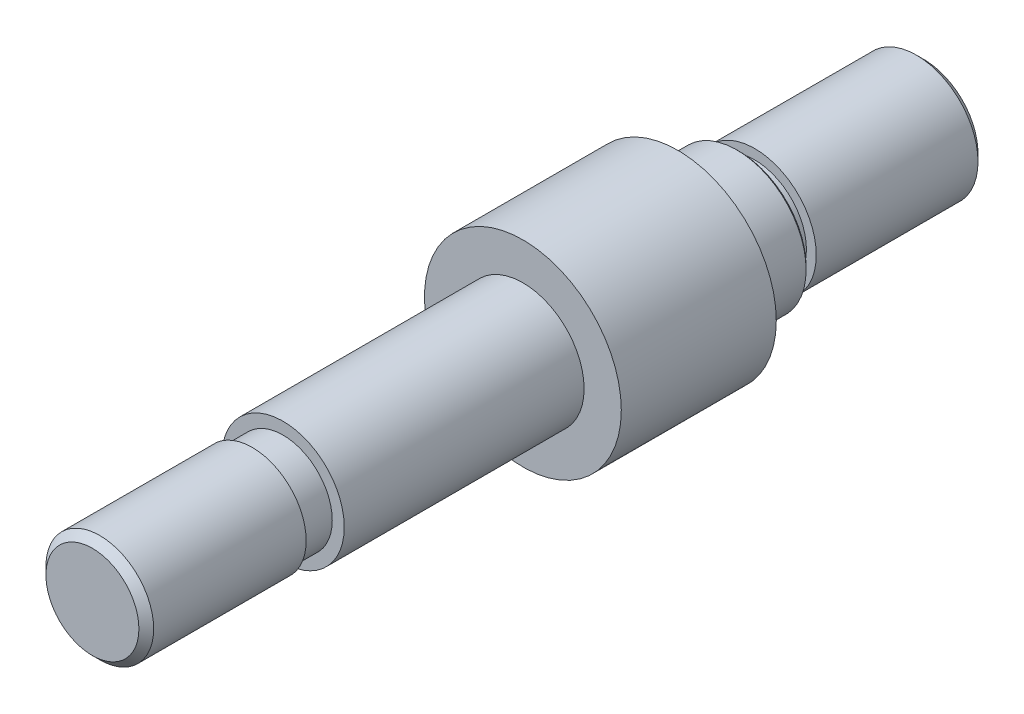
ISO-10303-21;
HEADER;
FILE_DESCRIPTION(('STEP AP214'),'2;1');
FILE_NAME('part.step','',(''),(''),'','','');
FILE_SCHEMA(('AUTOMOTIVE_DESIGN { 1 0 10303 214 1 1 1 1 }'));
ENDSEC;
DATA;
#1=APPLICATION_CONTEXT('core data for automotive mechanical design processes');
#2=APPLICATION_PROTOCOL_DEFINITION('international standard','automotive_design',2000,#1);
#3=PRODUCT_CONTEXT('',#1,'mechanical');
#4=PRODUCT('Part','Part','',(#3));
#5=PRODUCT_RELATED_PRODUCT_CATEGORY('part','',(#4));
#6=PRODUCT_DEFINITION_FORMATION('','',#4);
#7=PRODUCT_DEFINITION_CONTEXT('part definition',#1,'design');
#8=PRODUCT_DEFINITION('design','',#6,#7);
#9=PRODUCT_DEFINITION_SHAPE('','',#8);
#10=(LENGTH_UNIT() NAMED_UNIT(*) SI_UNIT(.MILLI.,.METRE.));
#11=(NAMED_UNIT(*) PLANE_ANGLE_UNIT() SI_UNIT($,.RADIAN.));
#12=(NAMED_UNIT(*) SI_UNIT($,.STERADIAN.) SOLID_ANGLE_UNIT());
#13=UNCERTAINTY_MEASURE_WITH_UNIT(LENGTH_MEASURE(1.E-05),#10,'distance_accuracy_value','');
#14=(GEOMETRIC_REPRESENTATION_CONTEXT(3) GLOBAL_UNCERTAINTY_ASSIGNED_CONTEXT((#13)) GLOBAL_UNIT_ASSIGNED_CONTEXT((#10,
#11,#12)) REPRESENTATION_CONTEXT('',''));
#15=CARTESIAN_POINT('',(0.,0.,0.));
#16=DIRECTION('',(0.,0.,1.));
#17=DIRECTION('',(1.,0.,0.));
#18=AXIS2_PLACEMENT_3D('',#15,#16,#17);
#19=CARTESIAN_POINT('',(0.,0.,60.452));
#20=DIRECTION('',(0.,0.,-1.));
#21=DIRECTION('',(-1.,0.,0.));
#22=AXIS2_PLACEMENT_3D('',#19,#20,#21);
#23=CYLINDRICAL_SURFACE('',#22,6.31825);
#24=CARTESIAN_POINT('',(0.,0.,16.002));
#25=DIRECTION('',(0.,0.,1.));
#26=DIRECTION('',(1.,0.,0.));
#27=AXIS2_PLACEMENT_3D('',#24,#25,#26);
#28=CIRCLE('',#27,6.31825);
#29=CARTESIAN_POINT('',(6.31825,0.,16.002));
#30=VERTEX_POINT('',#29);
#31=EDGE_CURVE('E81',#30,#30,#28,.T.);
#32=ORIENTED_EDGE('',*,*,#31,.T.);
#33=EDGE_LOOP('',(#32));
#34=FACE_BOUND('',#33,.T.);
#35=CARTESIAN_POINT('',(0.,0.,40.767));
#36=DIRECTION('',(0.,0.,1.));
#37=DIRECTION('',(1.,0.,0.));
#38=AXIS2_PLACEMENT_3D('',#35,#36,#37);
#39=CIRCLE('',#38,6.31825);
#40=CARTESIAN_POINT('',(6.31825,0.,40.767));
#41=VERTEX_POINT('',#40);
#42=EDGE_CURVE('E52',#41,#41,#39,.T.);
#43=ORIENTED_EDGE('',*,*,#42,.F.);
#44=EDGE_LOOP('',(#43));
#45=FACE_BOUND('',#44,.T.);
#46=ADVANCED_FACE('F48',(#34,#45),#23,.T.);
#47=CARTESIAN_POINT('',(0.,0.,-6.35));
#48=DIRECTION('',(0.,0.,1.));
#49=DIRECTION('',(1.,0.,0.));
#50=AXIS2_PLACEMENT_3D('',#47,#48,#49);
#51=PLANE('',#50);
#52=CARTESIAN_POINT('',(0.,0.,-6.35));
#53=DIRECTION('',(0.,0.,1.));
#54=DIRECTION('',(1.,0.,0.));
#55=AXIS2_PLACEMENT_3D('',#52,#53,#54);
#56=CIRCLE('',#55,6.88975);
#57=CARTESIAN_POINT('',(6.88975,0.,-6.35));
#58=VERTEX_POINT('',#57);
#59=EDGE_CURVE('E68',#58,#58,#56,.F.);
#60=ORIENTED_EDGE('',*,*,#59,.T.);
#61=EDGE_LOOP('',(#60));
#62=FACE_BOUND('',#61,.T.);
#63=CARTESIAN_POINT('',(0.,0.,-6.35));
#64=DIRECTION('',(0.,0.,1.));
#65=DIRECTION('',(1.,0.,0.));
#66=AXIS2_PLACEMENT_3D('',#63,#64,#65);
#67=CIRCLE('',#66,5.334);
#68=CARTESIAN_POINT('',(5.334,0.,-6.35));
#69=VERTEX_POINT('',#68);
#70=EDGE_CURVE('E92',#69,#69,#67,.T.);
#71=ORIENTED_EDGE('',*,*,#70,.T.);
#72=EDGE_LOOP('',(#71));
#73=FACE_BOUND('',#72,.T.);
#74=ADVANCED_FACE('F123',(#62,#73),#51,.F.);
#75=CARTESIAN_POINT('',(0.,0.,16.002));
#76=DIRECTION('',(0.,0.,1.));
#77=DIRECTION('',(1.,0.,0.));
#78=AXIS2_PLACEMENT_3D('',#75,#76,#77);
#79=PLANE('',#78);
#80=CARTESIAN_POINT('',(0.,0.,16.002));
#81=DIRECTION('',(0.,0.,1.));
#82=DIRECTION('',(1.,0.,0.));
#83=AXIS2_PLACEMENT_3D('',#80,#81,#82);
#84=CIRCLE('',#83,10.16);
#85=CARTESIAN_POINT('',(10.16,0.,16.002));
#86=VERTEX_POINT('',#85);
#87=EDGE_CURVE('E77',#86,#86,#84,.T.);
#88=ORIENTED_EDGE('',*,*,#87,.T.);
#89=EDGE_LOOP('',(#88));
#90=FACE_BOUND('',#89,.T.);
#91=ORIENTED_EDGE('',*,*,#31,.F.);
#92=EDGE_LOOP('',(#91));
#93=FACE_BOUND('',#92,.T.);
#94=ADVANCED_FACE('F129',(#90,#93),#79,.T.);
#95=CARTESIAN_POINT('',(0.,0.,-6.35));
#96=DIRECTION('',(0.,0.,1.));
#97=DIRECTION('',(1.,0.,0.));
#98=AXIS2_PLACEMENT_3D('',#95,#96,#97);
#99=CYLINDRICAL_SURFACE('',#98,7.14375);
#100=CARTESIAN_POINT('',(0.,0.,-6.09599999999999));
#101=DIRECTION('',(0.,0.,1.));
#102=DIRECTION('',(1.,0.,0.));
#103=AXIS2_PLACEMENT_3D('',#100,#101,#102);
#104=CIRCLE('',#103,7.14375);
#105=CARTESIAN_POINT('',(7.14375,0.,-6.09599999999999));
#106=VERTEX_POINT('',#105);
#107=EDGE_CURVE('E71',#106,#106,#104,.T.);
#108=ORIENTED_EDGE('',*,*,#107,.T.);
#109=EDGE_LOOP('',(#108));
#110=FACE_BOUND('',#109,.T.);
#111=CARTESIAN_POINT('',(0.,0.,0.));
#112=DIRECTION('',(0.,0.,1.));
#113=DIRECTION('',(1.,0.,0.));
#114=AXIS2_PLACEMENT_3D('',#111,#112,#113);
#115=CIRCLE('',#114,7.14375);
#116=CARTESIAN_POINT('',(7.14375,0.,0.));
#117=VERTEX_POINT('',#116);
#118=EDGE_CURVE('E74',#117,#117,#115,.T.);
#119=ORIENTED_EDGE('',*,*,#118,.F.);
#120=EDGE_LOOP('',(#119));
#121=FACE_BOUND('',#120,.T.);
#122=ADVANCED_FACE('F138',(#110,#121),#99,.T.);
#123=CARTESIAN_POINT('',(0.,0.,16.002));
#124=DIRECTION('',(0.,0.,-1.));
#125=DIRECTION('',(-1.,0.,0.));
#126=AXIS2_PLACEMENT_3D('',#123,#124,#125);
#127=CYLINDRICAL_SURFACE('',#126,10.16);
#128=ORIENTED_EDGE('',*,*,#87,.F.);
#129=EDGE_LOOP('',(#128));
#130=FACE_BOUND('',#129,.T.);
#131=CARTESIAN_POINT('',(0.,0.,0.));
#132=DIRECTION('',(0.,0.,1.));
#133=DIRECTION('',(1.,0.,0.));
#134=AXIS2_PLACEMENT_3D('',#131,#132,#133);
#135=CIRCLE('',#134,10.16);
#136=CARTESIAN_POINT('',(10.16,0.,0.));
#137=VERTEX_POINT('',#136);
#138=EDGE_CURVE('E78',#137,#137,#135,.T.);
#139=ORIENTED_EDGE('',*,*,#138,.T.);
#140=EDGE_LOOP('',(#139));
#141=FACE_BOUND('',#140,.T.);
#142=ADVANCED_FACE('F144',(#130,#141),#127,.T.);
#143=CARTESIAN_POINT('',(0.,0.,0.));
#144=DIRECTION('',(0.,0.,1.));
#145=DIRECTION('',(1.,0.,0.));
#146=AXIS2_PLACEMENT_3D('',#143,#144,#145);
#147=PLANE('',#146);
#148=ORIENTED_EDGE('',*,*,#118,.T.);
#149=EDGE_LOOP('',(#148));
#150=FACE_BOUND('',#149,.T.);
#151=ORIENTED_EDGE('',*,*,#138,.F.);
#152=EDGE_LOOP('',(#151));
#153=FACE_BOUND('',#152,.T.);
#154=ADVANCED_FACE('F140',(#150,#153),#147,.F.);
#155=CARTESIAN_POINT('',(0.,0.,-6.09599999999999));
#156=DIRECTION('',(0.,0.,1.));
#157=DIRECTION('',(1.,0.,0.));
#158=AXIS2_PLACEMENT_3D('',#155,#156,#157);
#159=CONICAL_SURFACE('',#158,7.14375,0.785398163397445);
#160=ORIENTED_EDGE('',*,*,#59,.F.);
#161=EDGE_LOOP('',(#160));
#162=FACE_BOUND('',#161,.T.);
#163=ORIENTED_EDGE('',*,*,#107,.F.);
#164=EDGE_LOOP('',(#163));
#165=FACE_BOUND('',#164,.T.);
#166=ADVANCED_FACE('F143',(#162,#165),#159,.T.);
#167=CARTESIAN_POINT('',(-6.35,0.,-7.9375));
#168=DIRECTION('',(0.,0.,1.));
#169=DIRECTION('',(1.,0.,0.));
#170=AXIS2_PLACEMENT_3D('',#167,#168,#169);
#171=PLANE('',#170);
#172=CARTESIAN_POINT('',(0.,0.,-7.9375));
#173=DIRECTION('',(0.,0.,1.));
#174=DIRECTION('',(1.,0.,0.));
#175=AXIS2_PLACEMENT_3D('',#172,#173,#174);
#176=CIRCLE('',#175,6.35);
#177=CARTESIAN_POINT('',(6.35,0.,-7.9375));
#178=VERTEX_POINT('',#177);
#179=EDGE_CURVE('E86',#178,#178,#176,.T.);
#180=ORIENTED_EDGE('',*,*,#179,.T.);
#181=EDGE_LOOP('',(#180));
#182=FACE_BOUND('',#181,.T.);
#183=CARTESIAN_POINT('',(0.,0.,-7.9375));
#184=DIRECTION('',(0.,0.,1.));
#185=DIRECTION('',(1.,0.,0.));
#186=AXIS2_PLACEMENT_3D('',#183,#184,#185);
#187=CIRCLE('',#186,5.334);
#188=CARTESIAN_POINT('',(5.334,0.,-7.9375));
#189=VERTEX_POINT('',#188);
#190=EDGE_CURVE('E89',#189,#189,#187,.T.);
#191=ORIENTED_EDGE('',*,*,#190,.F.);
#192=EDGE_LOOP('',(#191));
#193=FACE_BOUND('',#192,.T.);
#194=ADVANCED_FACE('F153',(#182,#193),#171,.T.);
#195=CARTESIAN_POINT('',(0.,0.,0.));
#196=DIRECTION('',(0.,0.,1.));
#197=DIRECTION('',(1.,0.,0.));
#198=AXIS2_PLACEMENT_3D('',#195,#196,#197);
#199=CYLINDRICAL_SURFACE('',#198,5.334);
#200=ORIENTED_EDGE('',*,*,#190,.T.);
#201=EDGE_LOOP('',(#200));
#202=FACE_BOUND('',#201,.T.);
#203=ORIENTED_EDGE('',*,*,#70,.F.);
#204=EDGE_LOOP('',(#203));
#205=FACE_BOUND('',#204,.T.);
#206=ADVANCED_FACE('F212',(#202,#205),#199,.T.);
#207=CARTESIAN_POINT('',(0.,0.,-25.4));
#208=DIRECTION('',(0.,0.,-1.));
#209=DIRECTION('',(-1.,0.,0.));
#210=AXIS2_PLACEMENT_3D('',#207,#208,#209);
#211=PLANE('',#210);
#212=CARTESIAN_POINT('',(0.,0.,-25.4));
#213=DIRECTION('',(0.,0.,-1.));
#214=DIRECTION('',(-1.,0.,0.));
#215=AXIS2_PLACEMENT_3D('',#212,#213,#214);
#216=CIRCLE('',#215,5.58800000000004);
#217=CARTESIAN_POINT('',(-5.58800000000004,0.,-25.4));
#218=VERTEX_POINT('',#217);
#219=EDGE_CURVE('E56',#218,#218,#216,.T.);
#220=ORIENTED_EDGE('',*,*,#219,.T.);
#221=EDGE_LOOP('',(#220));
#222=FACE_BOUND('',#221,.T.);
#223=ADVANCED_FACE('F216',(#222),#211,.T.);
#224=CARTESIAN_POINT('',(0.,0.,-25.4));
#225=DIRECTION('',(0.,0.,1.));
#226=DIRECTION('',(1.,0.,0.));
#227=AXIS2_PLACEMENT_3D('',#224,#225,#226);
#228=CONICAL_SURFACE('',#227,5.58800000000004,0.785398163397452);
#229=CARTESIAN_POINT('',(0.,0.,-24.638));
#230=DIRECTION('',(0.,0.,-1.));
#231=DIRECTION('',(-1.,0.,0.));
#232=AXIS2_PLACEMENT_3D('',#229,#230,#231);
#233=CIRCLE('',#232,6.35);
#234=CARTESIAN_POINT('',(-6.35,0.,-24.638));
#235=VERTEX_POINT('',#234);
#236=EDGE_CURVE('E12',#235,#235,#233,.F.);
#237=ORIENTED_EDGE('',*,*,#236,.F.);
#238=EDGE_LOOP('',(#237));
#239=FACE_BOUND('',#238,.T.);
#240=ORIENTED_EDGE('',*,*,#219,.F.);
#241=EDGE_LOOP('',(#240));
#242=FACE_BOUND('',#241,.T.);
#243=ADVANCED_FACE('F50',(#239,#242),#228,.T.);
#244=CARTESIAN_POINT('',(0.,0.,-25.4));
#245=DIRECTION('',(0.,0.,1.));
#246=DIRECTION('',(1.,0.,0.));
#247=AXIS2_PLACEMENT_3D('',#244,#245,#246);
#248=CYLINDRICAL_SURFACE('',#247,6.35);
#249=ORIENTED_EDGE('',*,*,#236,.T.);
#250=EDGE_LOOP('',(#249));
#251=FACE_BOUND('',#250,.T.);
#252=ORIENTED_EDGE('',*,*,#179,.F.);
#253=EDGE_LOOP('',(#252));
#254=FACE_BOUND('',#253,.T.);
#255=ADVANCED_FACE('F119',(#251,#254),#248,.T.);
#256=CARTESIAN_POINT('',(-6.35,0.,40.767));
#257=DIRECTION('',(0.,0.,1.));
#258=DIRECTION('',(1.,0.,0.));
#259=AXIS2_PLACEMENT_3D('',#256,#257,#258);
#260=PLANE('',#259);
#261=CARTESIAN_POINT('',(0.,0.,40.767));
#262=DIRECTION('',(0.,0.,1.));
#263=DIRECTION('',(1.,0.,0.));
#264=AXIS2_PLACEMENT_3D('',#261,#262,#263);
#265=CIRCLE('',#264,5.08);
#266=CARTESIAN_POINT('',(5.08,0.,40.767));
#267=VERTEX_POINT('',#266);
#268=EDGE_CURVE('E98',#267,#267,#265,.T.);
#269=ORIENTED_EDGE('',*,*,#268,.F.);
#270=EDGE_LOOP('',(#269));
#271=FACE_BOUND('',#270,.T.);
#272=ORIENTED_EDGE('',*,*,#42,.T.);
#273=EDGE_LOOP('',(#272));
#274=FACE_BOUND('',#273,.T.);
#275=ADVANCED_FACE('F109',(#271,#274),#260,.T.);
#276=CARTESIAN_POINT('',(0.,0.,67.9848785412061));
#277=DIRECTION('',(0.,0.,1.));
#278=DIRECTION('',(1.,0.,0.));
#279=AXIS2_PLACEMENT_3D('',#276,#277,#278);
#280=CYLINDRICAL_SURFACE('',#279,5.08);
#281=ORIENTED_EDGE('',*,*,#268,.T.);
#282=EDGE_LOOP('',(#281));
#283=FACE_BOUND('',#282,.T.);
#284=CARTESIAN_POINT('',(0.,0.,43.942));
#285=DIRECTION('',(0.,0.,1.));
#286=DIRECTION('',(1.,0.,0.));
#287=AXIS2_PLACEMENT_3D('',#284,#285,#286);
#288=CIRCLE('',#287,5.08);
#289=CARTESIAN_POINT('',(5.08,0.,43.942));
#290=VERTEX_POINT('',#289);
#291=EDGE_CURVE('E101',#290,#290,#288,.T.);
#292=ORIENTED_EDGE('',*,*,#291,.F.);
#293=EDGE_LOOP('',(#292));
#294=FACE_BOUND('',#293,.T.);
#295=ADVANCED_FACE('F107',(#283,#294),#280,.T.);
#296=CARTESIAN_POINT('',(-6.35,0.,43.942));
#297=DIRECTION('',(0.,0.,-1.));
#298=DIRECTION('',(-1.,0.,0.));
#299=AXIS2_PLACEMENT_3D('',#296,#297,#298);
#300=PLANE('',#299);
#301=CARTESIAN_POINT('',(0.,0.,43.942));
#302=DIRECTION('',(0.,0.,-1.));
#303=DIRECTION('',(-1.,0.,0.));
#304=AXIS2_PLACEMENT_3D('',#301,#302,#303);
#305=CIRCLE('',#304,5.5626);
#306=CARTESIAN_POINT('',(-5.5626,0.,43.942));
#307=VERTEX_POINT('',#306);
#308=EDGE_CURVE('E95',#307,#307,#305,.F.);
#309=ORIENTED_EDGE('',*,*,#308,.F.);
#310=EDGE_LOOP('',(#309));
#311=FACE_BOUND('',#310,.T.);
#312=ORIENTED_EDGE('',*,*,#291,.T.);
#313=EDGE_LOOP('',(#312));
#314=FACE_BOUND('',#313,.T.);
#315=ADVANCED_FACE('F105',(#311,#314),#300,.T.);
#316=CARTESIAN_POINT('',(0.,0.,60.452));
#317=DIRECTION('',(0.,0.,1.));
#318=DIRECTION('',(1.,0.,0.));
#319=AXIS2_PLACEMENT_3D('',#316,#317,#318);
#320=PLANE('',#319);
#321=CARTESIAN_POINT('',(0.,0.,60.452));
#322=DIRECTION('',(0.,0.,1.));
#323=DIRECTION('',(1.,0.,0.));
#324=AXIS2_PLACEMENT_3D('',#321,#322,#323);
#325=CIRCLE('',#324,4.80060000000003);
#326=CARTESIAN_POINT('',(4.80060000000003,0.,60.452));
#327=VERTEX_POINT('',#326);
#328=EDGE_CURVE('E65',#327,#327,#325,.T.);
#329=ORIENTED_EDGE('',*,*,#328,.T.);
#330=EDGE_LOOP('',(#329));
#331=FACE_BOUND('',#330,.T.);
#332=ADVANCED_FACE('F116',(#331),#320,.T.);
#333=CARTESIAN_POINT('',(0.,0.,60.452));
#334=DIRECTION('',(0.,0.,-1.));
#335=DIRECTION('',(-1.,0.,0.));
#336=AXIS2_PLACEMENT_3D('',#333,#334,#335);
#337=CONICAL_SURFACE('',#336,4.80060000000003,0.785398163397444);
#338=CARTESIAN_POINT('',(0.,0.,59.69));
#339=DIRECTION('',(0.,0.,1.));
#340=DIRECTION('',(1.,0.,0.));
#341=AXIS2_PLACEMENT_3D('',#338,#339,#340);
#342=CIRCLE('',#341,5.5626);
#343=CARTESIAN_POINT('',(5.5626,0.,59.69));
#344=VERTEX_POINT('',#343);
#345=EDGE_CURVE('E60',#344,#344,#342,.F.);
#346=ORIENTED_EDGE('',*,*,#345,.F.);
#347=EDGE_LOOP('',(#346));
#348=FACE_BOUND('',#347,.T.);
#349=ORIENTED_EDGE('',*,*,#328,.F.);
#350=EDGE_LOOP('',(#349));
#351=FACE_BOUND('',#350,.T.);
#352=ADVANCED_FACE('F155',(#348,#351),#337,.T.);
#353=CARTESIAN_POINT('',(0.,0.,43.942));
#354=DIRECTION('',(0.,0.,1.));
#355=DIRECTION('',(1.,0.,0.));
#356=AXIS2_PLACEMENT_3D('',#353,#354,#355);
#357=CYLINDRICAL_SURFACE('',#356,5.5626);
#358=ORIENTED_EDGE('',*,*,#345,.T.);
#359=EDGE_LOOP('',(#358));
#360=FACE_BOUND('',#359,.T.);
#361=ORIENTED_EDGE('',*,*,#308,.T.);
#362=EDGE_LOOP('',(#361));
#363=FACE_BOUND('',#362,.T.);
#364=ADVANCED_FACE('F157',(#360,#363),#357,.T.);
#365=CLOSED_SHELL('',(#46,#74,#94,#122,#142,#154,#166,#194,#206,#223,#243,#255,#275,#295,#315,
#332,#352,#364));
#366=MANIFOLD_SOLID_BREP('B2',#365);
#367=ADVANCED_BREP_SHAPE_REPRESENTATION('',(#18,#366),#14);
#368=SHAPE_DEFINITION_REPRESENTATION(#9,#367);
ENDSEC;
END-ISO-10303-21;
